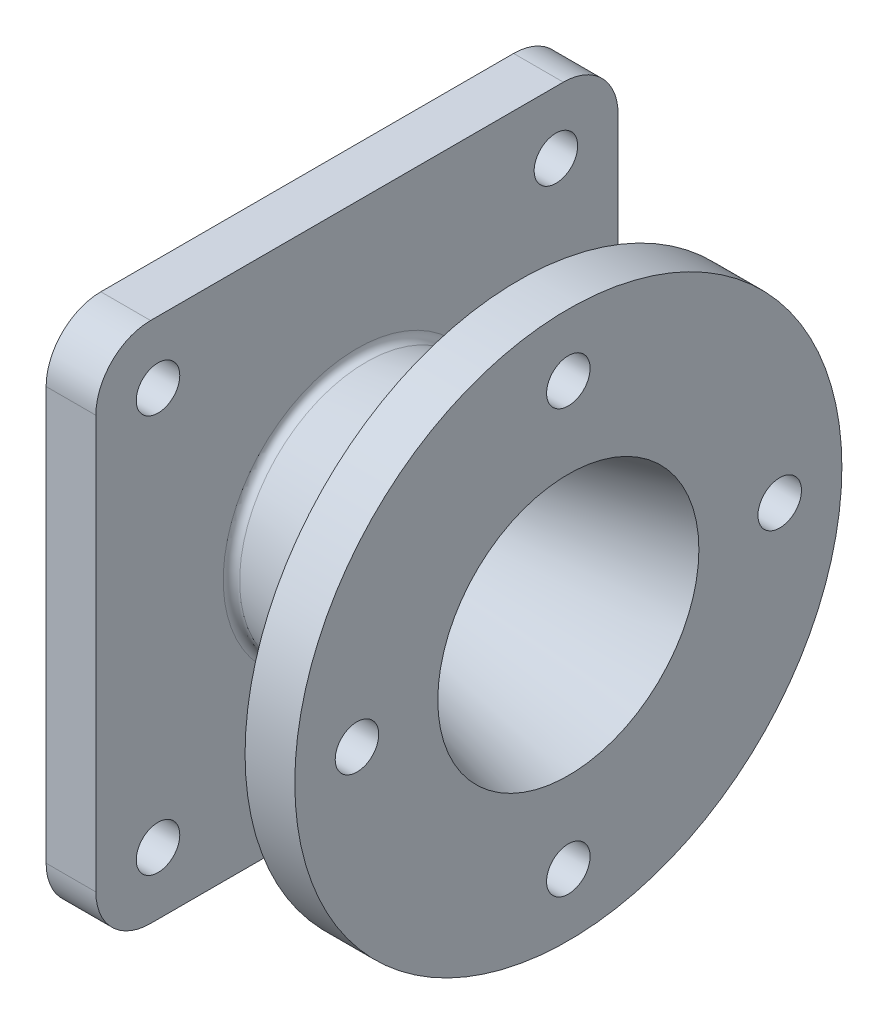
ISO-10303-21;
HEADER;
FILE_DESCRIPTION(('STEP AP214'),'2;1');
FILE_NAME('part.step','',(''),(''),'','','');
FILE_SCHEMA(('AUTOMOTIVE_DESIGN { 1 0 10303 214 1 1 1 1 }'));
ENDSEC;
DATA;
#1=APPLICATION_CONTEXT('core data for automotive mechanical design processes');
#2=APPLICATION_PROTOCOL_DEFINITION('international standard','automotive_design',2000,#1);
#3=PRODUCT_CONTEXT('',#1,'mechanical');
#4=PRODUCT('Part','Part','',(#3));
#5=PRODUCT_RELATED_PRODUCT_CATEGORY('part','',(#4));
#6=PRODUCT_DEFINITION_FORMATION('','',#4);
#7=PRODUCT_DEFINITION_CONTEXT('part definition',#1,'design');
#8=PRODUCT_DEFINITION('design','',#6,#7);
#9=PRODUCT_DEFINITION_SHAPE('','',#8);
#10=(LENGTH_UNIT() NAMED_UNIT(*) SI_UNIT(.MILLI.,.METRE.));
#11=(NAMED_UNIT(*) PLANE_ANGLE_UNIT() SI_UNIT($,.RADIAN.));
#12=(NAMED_UNIT(*) SI_UNIT($,.STERADIAN.) SOLID_ANGLE_UNIT());
#13=UNCERTAINTY_MEASURE_WITH_UNIT(LENGTH_MEASURE(1.E-05),#10,'distance_accuracy_value','');
#14=(GEOMETRIC_REPRESENTATION_CONTEXT(3) GLOBAL_UNCERTAINTY_ASSIGNED_CONTEXT((#13)) GLOBAL_UNIT_ASSIGNED_CONTEXT((#10,
#11,#12)) REPRESENTATION_CONTEXT('',''));
#15=CARTESIAN_POINT('',(0.,0.,0.));
#16=DIRECTION('',(0.,0.,1.));
#17=DIRECTION('',(1.,0.,0.));
#18=AXIS2_PLACEMENT_3D('',#15,#16,#17);
#19=CARTESIAN_POINT('',(-105.,0.,4.51745065771862E-13));
#20=DIRECTION('',(1.,0.,0.));
#21=DIRECTION('',(0.,0.,-1.00000000000003));
#22=AXIS2_PLACEMENT_3D('',#19,#20,#21);
#23=CONICAL_SURFACE('',#22,25.,0.256151382565604);
#24=CARTESIAN_POINT('',(0.,0.,0.));
#25=DIRECTION('',(1.,0.,0.));
#26=DIRECTION('',(0.,0.,-1.00000000000003));
#27=AXIS2_PLACEMENT_3D('',#24,#25,#26);
#28=CIRCLE('',#27,52.5);
#29=CARTESIAN_POINT('',(2.25872532885931E-13,0.,-52.5000000000015));
#30=VERTEX_POINT('',#29);
#31=EDGE_CURVE('E225',#30,#30,#28,.T.);
#32=ORIENTED_EDGE('',*,*,#31,.T.);
#33=EDGE_LOOP('',(#32));
#34=FACE_BOUND('',#33,.T.);
#35=CARTESIAN_POINT('',(-105.,0.,4.51745065771862E-13));
#36=DIRECTION('',(1.,0.,0.));
#37=DIRECTION('',(0.,0.,-1.00000000000003));
#38=AXIS2_PLACEMENT_3D('',#35,#36,#37);
#39=CIRCLE('',#38,25.);
#40=CARTESIAN_POINT('',(-105.,0.,-25.0000000000003));
#41=VERTEX_POINT('',#40);
#42=EDGE_CURVE('E137',#41,#41,#39,.T.);
#43=ORIENTED_EDGE('',*,*,#42,.F.);
#44=EDGE_LOOP('',(#43));
#45=FACE_BOUND('',#44,.T.);
#46=ADVANCED_FACE('F49',(#34,#45),#23,.F.);
#47=CARTESIAN_POINT('',(-105.,25.0000000000008,4.05948366006073E-13));
#48=DIRECTION('',(-1.,0.,0.));
#49=DIRECTION('',(0.,0.,1.00000000000003));
#50=AXIS2_PLACEMENT_3D('',#47,#48,#49);
#51=PLANE('',#50);
#52=ORIENTED_EDGE('',*,*,#42,.T.);
#53=EDGE_LOOP('',(#52));
#54=FACE_BOUND('',#53,.T.);
#55=CARTESIAN_POINT('',(-105.,0.,4.51745065771862E-13));
#56=DIRECTION('',(1.,0.,0.));
#57=DIRECTION('',(0.,0.,-1.00000000000003));
#58=AXIS2_PLACEMENT_3D('',#55,#56,#57);
#59=CIRCLE('',#58,35.);
#60=CARTESIAN_POINT('',(-105.,0.,-35.0000000000006));
#61=VERTEX_POINT('',#60);
#62=EDGE_CURVE('E141',#61,#61,#59,.T.);
#63=ORIENTED_EDGE('',*,*,#62,.F.);
#64=EDGE_LOOP('',(#63));
#65=FACE_BOUND('',#64,.T.);
#66=ADVANCED_FACE('F242',(#54,#65),#51,.T.);
#67=CARTESIAN_POINT('',(0.,0.,0.));
#68=DIRECTION('',(1.,0.,0.));
#69=DIRECTION('',(0.,0.,-1.00000000000003));
#70=AXIS2_PLACEMENT_3D('',#67,#68,#69);
#71=CYLINDRICAL_SURFACE('',#70,35.);
#72=ORIENTED_EDGE('',*,*,#62,.T.);
#73=EDGE_LOOP('',(#72));
#74=FACE_BOUND('',#73,.T.);
#75=CARTESIAN_POINT('',(-113.,0.,4.86163737449719E-13));
#76=DIRECTION('',(1.,0.,0.));
#77=DIRECTION('',(0.,0.,-1.00000000000003));
#78=AXIS2_PLACEMENT_3D('',#75,#76,#77);
#79=CIRCLE('',#78,35.);
#80=CARTESIAN_POINT('',(-113.,0.,-35.0000000000005));
#81=VERTEX_POINT('',#80);
#82=EDGE_CURVE('E234',#81,#81,#79,.T.);
#83=ORIENTED_EDGE('',*,*,#82,.F.);
#84=EDGE_LOOP('',(#83));
#85=FACE_BOUND('',#84,.T.);
#86=ADVANCED_FACE('F239',(#74,#85),#71,.F.);
#87=CARTESIAN_POINT('',(-113.,35.0000000000008,4.22048357777615E-13));
#88=DIRECTION('',(1.,0.,0.));
#89=DIRECTION('',(0.,0.,-1.00000000000003));
#90=AXIS2_PLACEMENT_3D('',#87,#88,#89);
#91=PLANE('',#90);
#92=ORIENTED_EDGE('',*,*,#82,.T.);
#93=EDGE_LOOP('',(#92));
#94=FACE_BOUND('',#93,.T.);
#95=CARTESIAN_POINT('',(-113.,0.,4.86163737449719E-13));
#96=DIRECTION('',(1.,0.,0.));
#97=DIRECTION('',(0.,0.,-1.00000000000003));
#98=AXIS2_PLACEMENT_3D('',#95,#96,#97);
#99=CIRCLE('',#98,28.7125);
#100=CARTESIAN_POINT('',(-113.,0.,-28.7125000000003));
#101=VERTEX_POINT('',#100);
#102=EDGE_CURVE('E231',#101,#101,#99,.T.);
#103=ORIENTED_EDGE('',*,*,#102,.F.);
#104=EDGE_LOOP('',(#103));
#105=FACE_BOUND('',#104,.T.);
#106=ADVANCED_FACE('F250',(#94,#105),#91,.T.);
#107=CARTESIAN_POINT('',(0.,0.,0.));
#108=DIRECTION('',(1.,0.,0.));
#109=DIRECTION('',(0.,0.,-1.00000000000003));
#110=AXIS2_PLACEMENT_3D('',#107,#108,#109);
#111=CYLINDRICAL_SURFACE('',#110,28.7125);
#112=CARTESIAN_POINT('',(-126.7125,0.,5.45159491872543E-13));
#113=DIRECTION('',(-1.,0.,0.));
#114=DIRECTION('',(0.,0.,1.00000000000003));
#115=AXIS2_PLACEMENT_3D('',#112,#113,#114);
#116=CIRCLE('',#115,28.7125);
#117=CARTESIAN_POINT('',(-126.7125,0.,28.7125000000014));
#118=VERTEX_POINT('',#117);
#119=EDGE_CURVE('E173',#118,#118,#116,.T.);
#120=ORIENTED_EDGE('',*,*,#119,.T.);
#121=EDGE_LOOP('',(#120));
#122=FACE_BOUND('',#121,.T.);
#123=ORIENTED_EDGE('',*,*,#102,.T.);
#124=EDGE_LOOP('',(#123));
#125=FACE_BOUND('',#124,.T.);
#126=ADVANCED_FACE('F289',(#122,#125),#111,.F.);
#127=CARTESIAN_POINT('',(-130.,62.5000000000024,4.4481166535069E-13));
#128=DIRECTION('',(-1.,0.,0.));
#129=DIRECTION('',(0.,0.,1.00000000000003));
#130=AXIS2_PLACEMENT_3D('',#127,#128,#129);
#131=PLANE('',#130);
#132=CARTESIAN_POINT('',(-130.,0.,5.59303414765163E-13));
#133=DIRECTION('',(-1.,0.,0.));
#134=DIRECTION('',(0.,0.,1.00000000000003));
#135=AXIS2_PLACEMENT_3D('',#132,#133,#134);
#136=CIRCLE('',#135,31.9999999999999);
#137=CARTESIAN_POINT('',(-130.,0.,32.0000000000014));
#138=VERTEX_POINT('',#137);
#139=EDGE_CURVE('E170',#138,#138,#136,.F.);
#140=ORIENTED_EDGE('',*,*,#139,.T.);
#141=EDGE_LOOP('',(#140));
#142=FACE_BOUND('',#141,.T.);
#143=CARTESIAN_POINT('',(-130.,0.,5.59303414765163E-13));
#144=DIRECTION('',(1.,0.,0.));
#145=DIRECTION('',(0.,0.,-1.00000000000003));
#146=AXIS2_PLACEMENT_3D('',#143,#144,#145);
#147=CIRCLE('',#146,62.5);
#148=CARTESIAN_POINT('',(-130.,1.14316369709669E-13,-62.5000000000013));
#149=VERTEX_POINT('',#148);
#150=EDGE_CURVE('E222',#149,#149,#147,.T.);
#151=ORIENTED_EDGE('',*,*,#150,.F.);
#152=EDGE_LOOP('',(#151));
#153=FACE_BOUND('',#152,.T.);
#154=ADVANCED_FACE('F285',(#142,#153),#131,.T.);
#155=CARTESIAN_POINT('',(0.,0.,0.));
#156=DIRECTION('',(1.,0.,0.));
#157=DIRECTION('',(0.,0.,-1.00000000000003));
#158=AXIS2_PLACEMENT_3D('',#155,#156,#157);
#159=CYLINDRICAL_SURFACE('',#158,62.5);
#160=ORIENTED_EDGE('',*,*,#150,.T.);
#161=EDGE_LOOP('',(#160));
#162=FACE_BOUND('',#161,.T.);
#163=CARTESIAN_POINT('',(-105.,0.,4.51745065771862E-13));
#164=DIRECTION('',(1.,0.,0.));
#165=DIRECTION('',(0.,0.,-1.00000000000003));
#166=AXIS2_PLACEMENT_3D('',#163,#164,#165);
#167=CIRCLE('',#166,62.5);
#168=CARTESIAN_POINT('',(-105.,1.14350096575978E-13,-62.5000000000014));
#169=VERTEX_POINT('',#168);
#170=EDGE_CURVE('E218',#169,#169,#167,.T.);
#171=ORIENTED_EDGE('',*,*,#170,.F.);
#172=EDGE_LOOP('',(#171));
#173=FACE_BOUND('',#172,.T.);
#174=ADVANCED_FACE('F288',(#162,#173),#159,.T.);
#175=CARTESIAN_POINT('',(-105.,105.000000000004,2.5939892675555E-13));
#176=DIRECTION('',(-1.,0.,0.));
#177=DIRECTION('',(0.,0.,1.00000000000003));
#178=AXIS2_PLACEMENT_3D('',#175,#176,#177);
#179=PLANE('',#178);
#180=CARTESIAN_POINT('',(-105.,80.0000000000036,-80.0000000000001));
#181=DIRECTION('',(-1.,0.,0.));
#182=DIRECTION('',(0.,1.00000000000003,0.));
#183=AXIS2_PLACEMENT_3D('',#180,#181,#182);
#184=CIRCLE('',#183,8.74999999999999);
#185=CARTESIAN_POINT('',(-105.,88.7500000000038,-80.));
#186=VERTEX_POINT('',#185);
#187=EDGE_CURVE('E580',#186,#186,#184,.T.);
#188=ORIENTED_EDGE('',*,*,#187,.F.);
#189=EDGE_LOOP('',(#188));
#190=FACE_BOUND('',#189,.T.);
#191=CARTESIAN_POINT('',(-105.,-80.000000000001,-80.));
#192=DIRECTION('',(-1.,0.,0.));
#193=DIRECTION('',(0.,0.,-1.00000000000003));
#194=AXIS2_PLACEMENT_3D('',#191,#192,#193);
#195=CIRCLE('',#194,8.74999999999999);
#196=CARTESIAN_POINT('',(-105.,-80.0000000000009,-88.7500000000003));
#197=VERTEX_POINT('',#196);
#198=EDGE_CURVE('E576',#197,#197,#195,.T.);
#199=ORIENTED_EDGE('',*,*,#198,.F.);
#200=EDGE_LOOP('',(#199));
#201=FACE_BOUND('',#200,.T.);
#202=CARTESIAN_POINT('',(-105.,-80.0000000000012,80.0000000000034));
#203=DIRECTION('',(-1.,0.,0.));
#204=DIRECTION('',(0.,-1.00000000000003,0.));
#205=AXIS2_PLACEMENT_3D('',#202,#203,#204);
#206=CIRCLE('',#205,8.74999999999999);
#207=CARTESIAN_POINT('',(-105.,-88.7500000000015,80.0000000000033));
#208=VERTEX_POINT('',#207);
#209=EDGE_CURVE('E572',#208,#208,#206,.T.);
#210=ORIENTED_EDGE('',*,*,#209,.F.);
#211=EDGE_LOOP('',(#210));
#212=FACE_BOUND('',#211,.T.);
#213=CARTESIAN_POINT('',(-105.,80.0000000000027,80.0000000000027));
#214=DIRECTION('',(-1.,0.,0.));
#215=DIRECTION('',(0.,0.,1.00000000000003));
#216=AXIS2_PLACEMENT_3D('',#213,#214,#215);
#217=CIRCLE('',#216,8.74999999999999);
#218=CARTESIAN_POINT('',(-105.,80.0000000000027,88.750000000003));
#219=VERTEX_POINT('',#218);
#220=EDGE_CURVE('E567',#219,#219,#217,.T.);
#221=ORIENTED_EDGE('',*,*,#220,.F.);
#222=EDGE_LOOP('',(#221));
#223=FACE_BOUND('',#222,.T.);
#224=ORIENTED_EDGE('',*,*,#170,.T.);
#225=EDGE_LOOP('',(#224));
#226=FACE_BOUND('',#225,.T.);
#227=DIRECTION('',(0.,0.,-1.00000000000003));
#228=VECTOR('',#227,1.);
#229=CARTESIAN_POINT('',(-105.,105.000000000005,-105.000000000003));
#230=LINE('',#229,#228);
#231=CARTESIAN_POINT('',(-105.,105.000000000004,83.0000000000027));
#232=VERTEX_POINT('',#231);
#233=CARTESIAN_POINT('',(-105.,105.000000000004,-83.0000000000009));
#234=VERTEX_POINT('',#233);
#235=EDGE_CURVE('E119',#232,#234,#230,.T.);
#236=ORIENTED_EDGE('',*,*,#235,.T.);
#237=CARTESIAN_POINT('',(-105.,83.0000000000027,-83.000000000001));
#238=DIRECTION('',(-1.,0.,0.));
#239=DIRECTION('',(0.,0.,1.00000000000003));
#240=AXIS2_PLACEMENT_3D('',#237,#238,#239);
#241=CIRCLE('',#240,22.);
#242=CARTESIAN_POINT('',(-105.,83.0000000000034,-105.000000000003));
#243=VERTEX_POINT('',#242);
#244=EDGE_CURVE('E148',#234,#243,#241,.T.);
#245=ORIENTED_EDGE('',*,*,#244,.T.);
#246=DIRECTION('',(0.,-1.00000000000003,0.));
#247=VECTOR('',#246,1.);
#248=CARTESIAN_POINT('',(-105.,-105.000000000002,-105.000000000002));
#249=LINE('',#248,#247);
#250=CARTESIAN_POINT('',(-105.,-83.0000000000009,-105.000000000002));
#251=VERTEX_POINT('',#250);
#252=EDGE_CURVE('E134',#243,#251,#249,.T.);
#253=ORIENTED_EDGE('',*,*,#252,.T.);
#254=CARTESIAN_POINT('',(-105.,-83.0000000000015,-83.0000000000006));
#255=DIRECTION('',(-1.,0.,0.));
#256=DIRECTION('',(0.,0.,1.00000000000003));
#257=AXIS2_PLACEMENT_3D('',#254,#255,#256);
#258=CIRCLE('',#257,22.);
#259=CARTESIAN_POINT('',(-105.,-105.000000000003,-83.0000000000006));
#260=VERTEX_POINT('',#259);
#261=EDGE_CURVE('E146',#251,#260,#258,.T.);
#262=ORIENTED_EDGE('',*,*,#261,.T.);
#263=DIRECTION('',(0.,0.,1.00000000000003));
#264=VECTOR('',#263,1.);
#265=CARTESIAN_POINT('',(-105.,-105.000000000002,-105.000000000002));
#266=LINE('',#265,#264);
#267=CARTESIAN_POINT('',(-105.,-105.000000000003,83.000000000003));
#268=VERTEX_POINT('',#267);
#269=EDGE_CURVE('E517',#260,#268,#266,.T.);
#270=ORIENTED_EDGE('',*,*,#269,.T.);
#271=CARTESIAN_POINT('',(-105.,-83.0000000000015,83.000000000003));
#272=DIRECTION('',(-1.,0.,0.));
#273=DIRECTION('',(0.,0.,1.00000000000003));
#274=AXIS2_PLACEMENT_3D('',#271,#272,#273);
#275=CIRCLE('',#274,22.);
#276=CARTESIAN_POINT('',(-105.,-83.0000000000021,105.000000000005));
#277=VERTEX_POINT('',#276);
#278=EDGE_CURVE('E125',#268,#277,#275,.T.);
#279=ORIENTED_EDGE('',*,*,#278,.T.);
#280=DIRECTION('',(0.,1.00000000000003,0.));
#281=VECTOR('',#280,1.);
#282=CARTESIAN_POINT('',(-105.,-105.000000000003,105.000000000005));
#283=LINE('',#282,#281);
#284=CARTESIAN_POINT('',(-105.,83.0000000000021,105.000000000005));
#285=VERTEX_POINT('',#284);
#286=EDGE_CURVE('E120',#277,#285,#283,.T.);
#287=ORIENTED_EDGE('',*,*,#286,.T.);
#288=CARTESIAN_POINT('',(-105.,83.0000000000027,83.0000000000027));
#289=DIRECTION('',(-1.,0.,0.));
#290=DIRECTION('',(0.,0.,1.00000000000003));
#291=AXIS2_PLACEMENT_3D('',#288,#289,#290);
#292=CIRCLE('',#291,22.);
#293=EDGE_CURVE('E116',#285,#232,#292,.T.);
#294=ORIENTED_EDGE('',*,*,#293,.T.);
#295=EDGE_LOOP('',(#236,#245,#253,#262,#270,#279,#287,#294));
#296=FACE_BOUND('',#295,.T.);
#297=ADVANCED_FACE('F118',(#190,#201,#212,#223,#226,#296),#179,.T.);
#298=CARTESIAN_POINT('',(-85.,50.0000000000014,2.74104987045644E-13));
#299=DIRECTION('',(1.,0.,0.));
#300=DIRECTION('',(0.,0.,-1.00000000000003));
#301=AXIS2_PLACEMENT_3D('',#298,#299,#300);
#302=PLANE('',#301);
#303=CARTESIAN_POINT('',(-85.,0.,3.65698386577222E-13));
#304=DIRECTION('',(1.,0.,0.));
#305=DIRECTION('',(0.,0.,-1.00000000000003));
#306=AXIS2_PLACEMENT_3D('',#303,#304,#305);
#307=CIRCLE('',#306,53.7711532455676);
#308=CARTESIAN_POINT('',(-84.9999999999998,0.,-53.7711532455688));
#309=VERTEX_POINT('',#308);
#310=EDGE_CURVE('E13',#309,#309,#307,.F.);
#311=ORIENTED_EDGE('',*,*,#310,.T.);
#312=EDGE_LOOP('',(#311));
#313=FACE_BOUND('',#312,.T.);
#314=CARTESIAN_POINT('',(-85.,80.0000000000027,-80.0000000000001));
#315=DIRECTION('',(1.,0.,0.));
#316=DIRECTION('',(0.,0.,-1.00000000000003));
#317=AXIS2_PLACEMENT_3D('',#314,#315,#316);
#318=CIRCLE('',#317,8.74999999999999);
#319=CARTESIAN_POINT('',(-85.,80.0000000000027,-88.7500000000003));
#320=VERTEX_POINT('',#319);
#321=EDGE_CURVE('E492',#320,#320,#318,.F.);
#322=ORIENTED_EDGE('',*,*,#321,.T.);
#323=EDGE_LOOP('',(#322));
#324=FACE_BOUND('',#323,.T.);
#325=CARTESIAN_POINT('',(-85.,-80.0000000000019,-80.0000000000003));
#326=DIRECTION('',(1.,0.,0.));
#327=DIRECTION('',(0.,0.,-1.00000000000003));
#328=AXIS2_PLACEMENT_3D('',#325,#326,#327);
#329=CIRCLE('',#328,8.74999999999999);
#330=CARTESIAN_POINT('',(-85.,-80.0000000000018,-88.7500000000006));
#331=VERTEX_POINT('',#330);
#332=EDGE_CURVE('E496',#331,#331,#329,.F.);
#333=ORIENTED_EDGE('',*,*,#332,.T.);
#334=EDGE_LOOP('',(#333));
#335=FACE_BOUND('',#334,.T.);
#336=CARTESIAN_POINT('',(-85.,-80.0000000000021,80.0000000000031));
#337=DIRECTION('',(1.,0.,0.));
#338=DIRECTION('',(0.,0.,-1.00000000000003));
#339=AXIS2_PLACEMENT_3D('',#336,#337,#338);
#340=CIRCLE('',#339,8.74999999999999);
#341=CARTESIAN_POINT('',(-85.,-80.0000000000021,71.2500000000028));
#342=VERTEX_POINT('',#341);
#343=EDGE_CURVE('E500',#342,#342,#340,.F.);
#344=ORIENTED_EDGE('',*,*,#343,.T.);
#345=EDGE_LOOP('',(#344));
#346=FACE_BOUND('',#345,.T.);
#347=CARTESIAN_POINT('',(-85.,80.0000000000018,80.0000000000027));
#348=DIRECTION('',(1.,0.,0.));
#349=DIRECTION('',(0.,0.,-1.00000000000003));
#350=AXIS2_PLACEMENT_3D('',#347,#348,#349);
#351=CIRCLE('',#350,8.74999999999999);
#352=CARTESIAN_POINT('',(-85.,80.0000000000018,71.2500000000025));
#353=VERTEX_POINT('',#352);
#354=EDGE_CURVE('E503',#353,#353,#351,.F.);
#355=ORIENTED_EDGE('',*,*,#354,.T.);
#356=EDGE_LOOP('',(#355));
#357=FACE_BOUND('',#356,.T.);
#358=DIRECTION('',(0.,-1.00000000000003,0.));
#359=VECTOR('',#358,1.);
#360=CARTESIAN_POINT('',(-85.,-105.000000000003,-105.000000000002));
#361=LINE('',#360,#359);
#362=CARTESIAN_POINT('',(-85.,83.0000000000024,-105.000000000003));
#363=VERTEX_POINT('',#362);
#364=CARTESIAN_POINT('',(-85.,-83.0000000000018,-105.000000000002));
#365=VERTEX_POINT('',#364);
#366=EDGE_CURVE('E506',#363,#365,#361,.T.);
#367=ORIENTED_EDGE('',*,*,#366,.F.);
#368=CARTESIAN_POINT('',(-85.,83.0000000000018,-83.000000000001));
#369=DIRECTION('',(1.,0.,0.));
#370=DIRECTION('',(0.,0.,-1.00000000000003));
#371=AXIS2_PLACEMENT_3D('',#368,#369,#370);
#372=CIRCLE('',#371,22.);
#373=CARTESIAN_POINT('',(-85.,105.000000000003,-83.0000000000009));
#374=VERTEX_POINT('',#373);
#375=EDGE_CURVE('E160',#363,#374,#372,.T.);
#376=ORIENTED_EDGE('',*,*,#375,.T.);
#377=DIRECTION('',(0.,0.,-1.00000000000003));
#378=VECTOR('',#377,1.);
#379=CARTESIAN_POINT('',(-85.,105.000000000004,-105.000000000003));
#380=LINE('',#379,#378);
#381=CARTESIAN_POINT('',(-85.,105.000000000003,83.0000000000027));
#382=VERTEX_POINT('',#381);
#383=EDGE_CURVE('E511',#382,#374,#380,.T.);
#384=ORIENTED_EDGE('',*,*,#383,.F.);
#385=CARTESIAN_POINT('',(-85.,83.0000000000018,83.0000000000027));
#386=DIRECTION('',(1.,0.,0.));
#387=DIRECTION('',(0.,0.,-1.00000000000003));
#388=AXIS2_PLACEMENT_3D('',#385,#386,#387);
#389=CIRCLE('',#388,22.);
#390=CARTESIAN_POINT('',(-85.,83.0000000000012,105.000000000005));
#391=VERTEX_POINT('',#390);
#392=EDGE_CURVE('E64',#382,#391,#389,.T.);
#393=ORIENTED_EDGE('',*,*,#392,.T.);
#394=DIRECTION('',(0.,1.00000000000003,0.));
#395=VECTOR('',#394,1.);
#396=CARTESIAN_POINT('',(-85.,-105.000000000004,105.000000000005));
#397=LINE('',#396,#395);
#398=CARTESIAN_POINT('',(-85.,-83.000000000003,105.000000000005));
#399=VERTEX_POINT('',#398);
#400=EDGE_CURVE('E525',#399,#391,#397,.T.);
#401=ORIENTED_EDGE('',*,*,#400,.F.);
#402=CARTESIAN_POINT('',(-85.,-83.0000000000024,83.000000000003));
#403=DIRECTION('',(1.,0.,0.));
#404=DIRECTION('',(0.,0.,-1.00000000000003));
#405=AXIS2_PLACEMENT_3D('',#402,#403,#404);
#406=CIRCLE('',#405,22.);
#407=CARTESIAN_POINT('',(-85.,-105.000000000004,83.000000000003));
#408=VERTEX_POINT('',#407);
#409=EDGE_CURVE('E156',#399,#408,#406,.T.);
#410=ORIENTED_EDGE('',*,*,#409,.T.);
#411=DIRECTION('',(0.,0.,1.00000000000003));
#412=VECTOR('',#411,1.);
#413=CARTESIAN_POINT('',(-85.,-105.000000000003,-105.000000000002));
#414=LINE('',#413,#412);
#415=CARTESIAN_POINT('',(-85.,-105.000000000004,-83.0000000000006));
#416=VERTEX_POINT('',#415);
#417=EDGE_CURVE('E512',#416,#408,#414,.T.);
#418=ORIENTED_EDGE('',*,*,#417,.F.);
#419=CARTESIAN_POINT('',(-85.,-83.0000000000024,-83.0000000000006));
#420=DIRECTION('',(1.,0.,0.));
#421=DIRECTION('',(0.,0.,-1.00000000000003));
#422=AXIS2_PLACEMENT_3D('',#419,#420,#421);
#423=CIRCLE('',#422,22.);
#424=EDGE_CURVE('E158',#416,#365,#423,.T.);
#425=ORIENTED_EDGE('',*,*,#424,.T.);
#426=EDGE_LOOP('',(#367,#376,#384,#393,#401,#410,#418,#425));
#427=FACE_BOUND('',#426,.T.);
#428=ADVANCED_FACE('F299',(#313,#324,#335,#346,#357,#427),#302,.T.);
#429=CARTESIAN_POINT('',(-20.,0.,0.));
#430=DIRECTION('',(1.,0.,0.));
#431=DIRECTION('',(0.,0.,-1.00000000000003));
#432=AXIS2_PLACEMENT_3D('',#429,#430,#431);
#433=CONICAL_SURFACE('',#432,65.,0.226798848053886);
#434=CARTESIAN_POINT('',(-22.3254214799037,0.,0.));
#435=DIRECTION('',(1.,0.,0.));
#436=DIRECTION('',(0.,0.,-1.00000000000003));
#437=AXIS2_PLACEMENT_3D('',#434,#435,#436);
#438=CIRCLE('',#437,64.4633642738684);
#439=CARTESIAN_POINT('',(-22.3254214799034,1.24997148825408E-13,-64.4633642738702));
#440=VERTEX_POINT('',#439);
#441=EDGE_CURVE('E57',#440,#440,#438,.F.);
#442=ORIENTED_EDGE('',*,*,#441,.T.);
#443=EDGE_LOOP('',(#442));
#444=FACE_BOUND('',#443,.T.);
#445=CARTESIAN_POINT('',(-81.3254214799037,0.,3.49889122622511E-13));
#446=DIRECTION('',(1.,0.,0.));
#447=DIRECTION('',(0.,0.,-1.00000000000003));
#448=AXIS2_PLACEMENT_3D('',#445,#446,#447);
#449=CIRCLE('',#448,50.8479796584837);
#450=CARTESIAN_POINT('',(-81.3254214799035,0.,-50.8479796584849));
#451=VERTEX_POINT('',#450);
#452=EDGE_CURVE('E179',#451,#451,#449,.T.);
#453=ORIENTED_EDGE('',*,*,#452,.T.);
#454=EDGE_LOOP('',(#453));
#455=FACE_BOUND('',#454,.T.);
#456=ADVANCED_FACE('F184',(#444,#455),#433,.T.);
#457=CARTESIAN_POINT('',(-19.9999999999999,110.000000000004,-1.15458799774835E-13));
#458=DIRECTION('',(-1.,0.,0.));
#459=DIRECTION('',(0.,0.,1.00000000000003));
#460=AXIS2_PLACEMENT_3D('',#457,#458,#459);
#461=PLANE('',#460);
#462=CARTESIAN_POINT('',(-20.,0.,0.));
#463=DIRECTION('',(-1.,0.,0.));
#464=DIRECTION('',(0.,0.,1.00000000000003));
#465=AXIS2_PLACEMENT_3D('',#462,#463,#464);
#466=CIRCLE('',#465,67.3865378609522);
#467=CARTESIAN_POINT('',(-20.0000000000003,-1.23470223200007E-13,67.3865378609543));
#468=VERTEX_POINT('',#467);
#469=EDGE_CURVE('E176',#468,#468,#466,.F.);
#470=ORIENTED_EDGE('',*,*,#469,.T.);
#471=EDGE_LOOP('',(#470));
#472=FACE_BOUND('',#471,.T.);
#473=CARTESIAN_POINT('',(-20.,1.01020658197681E-12,-85.0000000000009));
#474=DIRECTION('',(-1.,0.,0.));
#475=DIRECTION('',(0.,0.,1.00000000000003));
#476=AXIS2_PLACEMENT_3D('',#473,#474,#475);
#477=CIRCLE('',#476,8.75);
#478=CARTESIAN_POINT('',(-20.0000000000001,9.94177737058781E-13,-76.2500000000007));
#479=VERTEX_POINT('',#478);
#480=EDGE_CURVE('E201',#479,#479,#477,.F.);
#481=ORIENTED_EDGE('',*,*,#480,.T.);
#482=EDGE_LOOP('',(#481));
#483=FACE_BOUND('',#482,.T.);
#484=CARTESIAN_POINT('',(-20.,-85.0000000000025,2.41755458398324E-13));
#485=DIRECTION('',(-1.,0.,0.));
#486=DIRECTION('',(0.,0.,1.00000000000003));
#487=AXIS2_PLACEMENT_3D('',#484,#485,#486);
#488=CIRCLE('',#487,8.75);
#489=CARTESIAN_POINT('',(-20.0000000000001,-85.0000000000025,8.7500000000005));
#490=VERTEX_POINT('',#489);
#491=EDGE_CURVE('E205',#490,#490,#488,.F.);
#492=ORIENTED_EDGE('',*,*,#491,.T.);
#493=EDGE_LOOP('',(#492));
#494=FACE_BOUND('',#493,.T.);
#495=CARTESIAN_POINT('',(-20.,-4.16985116178832E-13,85.0000000000028));
#496=DIRECTION('',(-1.,0.,0.));
#497=DIRECTION('',(0.,0.,1.00000000000003));
#498=AXIS2_PLACEMENT_3D('',#495,#496,#497);
#499=CIRCLE('',#498,8.75);
#500=CARTESIAN_POINT('',(-20.0000000000001,-4.33013961096858E-13,93.750000000003));
#501=VERTEX_POINT('',#500);
#502=EDGE_CURVE('E209',#501,#501,#499,.F.);
#503=ORIENTED_EDGE('',*,*,#502,.T.);
#504=EDGE_LOOP('',(#503));
#505=FACE_BOUND('',#504,.T.);
#506=CARTESIAN_POINT('',(-19.9999999999999,85.0000000000018,0.));
#507=DIRECTION('',(-1.,0.,0.));
#508=DIRECTION('',(0.,0.,1.00000000000003));
#509=AXIS2_PLACEMENT_3D('',#506,#507,#508);
#510=CIRCLE('',#509,8.75);
#511=CARTESIAN_POINT('',(-19.9999999999999,85.0000000000018,8.75000000000019));
#512=VERTEX_POINT('',#511);
#513=EDGE_CURVE('E213',#512,#512,#510,.F.);
#514=ORIENTED_EDGE('',*,*,#513,.T.);
#515=EDGE_LOOP('',(#514));
#516=FACE_BOUND('',#515,.T.);
#517=CARTESIAN_POINT('',(-19.9999999999999,0.,0.));
#518=DIRECTION('',(1.,0.,0.));
#519=DIRECTION('',(0.,0.,-1.00000000000003));
#520=AXIS2_PLACEMENT_3D('',#517,#518,#519);
#521=CIRCLE('',#520,110.);
#522=CARTESIAN_POINT('',(-19.9999999999994,2.01478497476425E-13,-110.000000000003));
#523=VERTEX_POINT('',#522);
#524=EDGE_CURVE('E216',#523,#523,#521,.T.);
#525=ORIENTED_EDGE('',*,*,#524,.F.);
#526=EDGE_LOOP('',(#525));
#527=FACE_BOUND('',#526,.T.);
#528=ADVANCED_FACE('F193',(#472,#483,#494,#505,#516,#527),#461,.T.);
#529=CARTESIAN_POINT('',(0.,0.,0.));
#530=DIRECTION('',(1.,0.,0.));
#531=DIRECTION('',(0.,0.,-1.00000000000003));
#532=AXIS2_PLACEMENT_3D('',#529,#530,#531);
#533=CYLINDRICAL_SURFACE('',#532,110.);
#534=ORIENTED_EDGE('',*,*,#524,.T.);
#535=EDGE_LOOP('',(#534));
#536=FACE_BOUND('',#535,.T.);
#537=CARTESIAN_POINT('',(0.,0.,0.));
#538=DIRECTION('',(1.,0.,0.));
#539=DIRECTION('',(0.,0.,-1.00000000000003));
#540=AXIS2_PLACEMENT_3D('',#537,#538,#539);
#541=CIRCLE('',#540,110.);
#542=CARTESIAN_POINT('',(4.73256735570522E-13,2.01505478969472E-13,-110.000000000003));
#543=VERTEX_POINT('',#542);
#544=EDGE_CURVE('E219',#543,#543,#541,.T.);
#545=ORIENTED_EDGE('',*,*,#544,.F.);
#546=EDGE_LOOP('',(#545));
#547=FACE_BOUND('',#546,.T.);
#548=ADVANCED_FACE('F196',(#536,#547),#533,.T.);
#549=CARTESIAN_POINT('',(0.,52.5000000000014,0.));
#550=DIRECTION('',(1.,0.,0.));
#551=DIRECTION('',(0.,0.,-1.00000000000003));
#552=AXIS2_PLACEMENT_3D('',#549,#550,#551);
#553=PLANE('',#552);
#554=CARTESIAN_POINT('',(0.,1.00329466956595E-12,-85.0000000000009));
#555=DIRECTION('',(1.,0.,0.));
#556=DIRECTION('',(0.,-1.00000000000003,0.));
#557=AXIS2_PLACEMENT_3D('',#554,#555,#556);
#558=CIRCLE('',#557,8.75);
#559=CARTESIAN_POINT('',(0.,-8.74999999999926,-85.000000000001));
#560=VERTEX_POINT('',#559);
#561=EDGE_CURVE('E529',#560,#560,#558,.T.);
#562=ORIENTED_EDGE('',*,*,#561,.F.);
#563=EDGE_LOOP('',(#562));
#564=FACE_BOUND('',#563,.T.);
#565=CARTESIAN_POINT('',(0.,-85.0000000000018,1.55708779203682E-13));
#566=DIRECTION('',(1.,0.,0.));
#567=DIRECTION('',(0.,0.,1.00000000000003));
#568=AXIS2_PLACEMENT_3D('',#565,#566,#567);
#569=CIRCLE('',#568,8.75);
#570=CARTESIAN_POINT('',(0.,-85.0000000000018,8.75000000000042));
#571=VERTEX_POINT('',#570);
#572=EDGE_CURVE('E533',#571,#571,#569,.T.);
#573=ORIENTED_EDGE('',*,*,#572,.F.);
#574=EDGE_LOOP('',(#573));
#575=FACE_BOUND('',#574,.T.);
#576=CARTESIAN_POINT('',(0.,-4.84612350248881E-13,85.0000000000028));
#577=DIRECTION('',(1.,0.,0.));
#578=DIRECTION('',(0.,1.00000000000003,0.));
#579=AXIS2_PLACEMENT_3D('',#576,#577,#578);
#580=CIRCLE('',#579,8.75);
#581=CARTESIAN_POINT('',(0.,8.74999999999978,85.0000000000028));
#582=VERTEX_POINT('',#581);
#583=EDGE_CURVE('E537',#582,#582,#580,.T.);
#584=ORIENTED_EDGE('',*,*,#583,.F.);
#585=EDGE_LOOP('',(#584));
#586=FACE_BOUND('',#585,.T.);
#587=CARTESIAN_POINT('',(0.,85.0000000000025,-1.55708779203687E-13));
#588=DIRECTION('',(1.,0.,0.));
#589=DIRECTION('',(0.,0.,-1.00000000000003));
#590=AXIS2_PLACEMENT_3D('',#587,#588,#589);
#591=CIRCLE('',#590,8.75);
#592=CARTESIAN_POINT('',(0.,85.0000000000025,-8.75000000000042));
#593=VERTEX_POINT('',#592);
#594=EDGE_CURVE('E541',#593,#593,#591,.T.);
#595=ORIENTED_EDGE('',*,*,#594,.F.);
#596=EDGE_LOOP('',(#595));
#597=FACE_BOUND('',#596,.T.);
#598=ORIENTED_EDGE('',*,*,#544,.T.);
#599=EDGE_LOOP('',(#598));
#600=FACE_BOUND('',#599,.T.);
#601=ORIENTED_EDGE('',*,*,#31,.F.);
#602=EDGE_LOOP('',(#601));
#603=FACE_BOUND('',#602,.T.);
#604=ADVANCED_FACE('F364',(#564,#575,#586,#597,#600,#603),#553,.T.);
#605=CARTESIAN_POINT('',(-130.001,85.0000000000025,4.0359893789544E-13));
#606=DIRECTION('',(1.,0.,0.));
#607=DIRECTION('',(0.,0.,-1.00000000000003));
#608=AXIS2_PLACEMENT_3D('',#605,#606,#607);
#609=CYLINDRICAL_SURFACE('',#608,8.75);
#610=ORIENTED_EDGE('',*,*,#513,.F.);
#611=EDGE_LOOP('',(#610));
#612=FACE_BOUND('',#611,.T.);
#613=ORIENTED_EDGE('',*,*,#594,.T.);
#614=EDGE_LOOP('',(#613));
#615=FACE_BOUND('',#614,.T.);
#616=ADVANCED_FACE('F371',(#612,#615),#609,.F.);
#617=CARTESIAN_POINT('',(-130.001,-4.84787731302759E-13,85.0000000000037));
#618=DIRECTION('',(1.,0.,0.));
#619=DIRECTION('',(0.,0.,-1.00000000000003));
#620=AXIS2_PLACEMENT_3D('',#617,#618,#619);
#621=CYLINDRICAL_SURFACE('',#620,8.75);
#622=ORIENTED_EDGE('',*,*,#502,.F.);
#623=EDGE_LOOP('',(#622));
#624=FACE_BOUND('',#623,.T.);
#625=ORIENTED_EDGE('',*,*,#583,.T.);
#626=EDGE_LOOP('',(#625));
#627=FACE_BOUND('',#626,.T.);
#628=ADVANCED_FACE('F379',(#624,#627),#621,.F.);
#629=CARTESIAN_POINT('',(-130.001,-85.0000000000018,7.15016496302806E-13));
#630=DIRECTION('',(1.,0.,0.));
#631=DIRECTION('',(0.,0.,-1.00000000000003));
#632=AXIS2_PLACEMENT_3D('',#629,#630,#631);
#633=CYLINDRICAL_SURFACE('',#632,8.75);
#634=ORIENTED_EDGE('',*,*,#491,.F.);
#635=EDGE_LOOP('',(#634));
#636=FACE_BOUND('',#635,.T.);
#637=ORIENTED_EDGE('',*,*,#572,.T.);
#638=EDGE_LOOP('',(#637));
#639=FACE_BOUND('',#638,.T.);
#640=ADVANCED_FACE('F387',(#636,#639),#633,.F.);
#641=CARTESIAN_POINT('',(-130.001,1.00311928851207E-12,-85.));
#642=DIRECTION('',(1.,0.,0.));
#643=DIRECTION('',(0.,0.,-1.00000000000003));
#644=AXIS2_PLACEMENT_3D('',#641,#642,#643);
#645=CYLINDRICAL_SURFACE('',#644,8.75);
#646=ORIENTED_EDGE('',*,*,#480,.F.);
#647=EDGE_LOOP('',(#646));
#648=FACE_BOUND('',#647,.T.);
#649=ORIENTED_EDGE('',*,*,#561,.T.);
#650=EDGE_LOOP('',(#649));
#651=FACE_BOUND('',#650,.T.);
#652=ADVANCED_FACE('F394',(#648,#651),#645,.F.);
#653=CARTESIAN_POINT('',(211.98484809835,-105.000000000004,105.000000000003));
#654=DIRECTION('',(0.,0.,1.00000000000003));
#655=DIRECTION('',(1.,0.,0.));
#656=AXIS2_PLACEMENT_3D('',#653,#654,#655);
#657=PLANE('',#656);
#658=ORIENTED_EDGE('',*,*,#286,.F.);
#659=DIRECTION('',(-1.,0.,0.));
#660=VECTOR('',#659,1.);
#661=CARTESIAN_POINT('',(211.98484809835,-83.0000000000024,105.000000000003));
#662=LINE('',#661,#660);
#663=EDGE_CURVE('E71',#277,#399,#662,.F.);
#664=ORIENTED_EDGE('',*,*,#663,.T.);
#665=ORIENTED_EDGE('',*,*,#400,.T.);
#666=DIRECTION('',(-1.,0.,0.));
#667=VECTOR('',#666,1.);
#668=CARTESIAN_POINT('',(211.98484809835,83.0000000000018,105.000000000003));
#669=LINE('',#668,#667);
#670=EDGE_CURVE('E167',#391,#285,#669,.T.);
#671=ORIENTED_EDGE('',*,*,#670,.T.);
#672=EDGE_LOOP('',(#658,#664,#665,#671));
#673=FACE_BOUND('',#672,.T.);
#674=ADVANCED_FACE('F401',(#673),#657,.T.);
#675=CARTESIAN_POINT('',(211.98484809835,-105.000000000003,-105.000000000004));
#676=DIRECTION('',(0.,-1.00000000000003,0.));
#677=DIRECTION('',(0.,0.,-1.00000000000003));
#678=AXIS2_PLACEMENT_3D('',#675,#676,#677);
#679=PLANE('',#678);
#680=ORIENTED_EDGE('',*,*,#269,.F.);
#681=DIRECTION('',(-1.,0.,0.));
#682=VECTOR('',#681,1.);
#683=CARTESIAN_POINT('',(211.98484809835,-105.000000000003,-83.0000000000021));
#684=LINE('',#683,#682);
#685=EDGE_CURVE('E165',#260,#416,#684,.F.);
#686=ORIENTED_EDGE('',*,*,#685,.T.);
#687=ORIENTED_EDGE('',*,*,#417,.T.);
#688=DIRECTION('',(-1.,0.,0.));
#689=VECTOR('',#688,1.);
#690=CARTESIAN_POINT('',(211.98484809835,-105.000000000003,83.0000000000015));
#691=LINE('',#690,#689);
#692=EDGE_CURVE('E162',#408,#268,#691,.T.);
#693=ORIENTED_EDGE('',*,*,#692,.T.);
#694=EDGE_LOOP('',(#680,#686,#687,#693));
#695=FACE_BOUND('',#694,.T.);
#696=ADVANCED_FACE('F408',(#695),#679,.T.);
#697=CARTESIAN_POINT('',(211.98484809835,-105.000000000003,-105.000000000004));
#698=DIRECTION('',(0.,0.,-1.00000000000003));
#699=DIRECTION('',(-1.,0.,0.));
#700=AXIS2_PLACEMENT_3D('',#697,#698,#699);
#701=PLANE('',#700);
#702=ORIENTED_EDGE('',*,*,#252,.F.);
#703=DIRECTION('',(-1.,0.,0.));
#704=VECTOR('',#703,1.);
#705=CARTESIAN_POINT('',(211.98484809835,83.0000000000024,-105.000000000004));
#706=LINE('',#705,#704);
#707=EDGE_CURVE('E153',#243,#363,#706,.F.);
#708=ORIENTED_EDGE('',*,*,#707,.T.);
#709=ORIENTED_EDGE('',*,*,#366,.T.);
#710=DIRECTION('',(-1.,0.,0.));
#711=VECTOR('',#710,1.);
#712=CARTESIAN_POINT('',(211.98484809835,-83.0000000000018,-105.000000000004));
#713=LINE('',#712,#711);
#714=EDGE_CURVE('E150',#365,#251,#713,.T.);
#715=ORIENTED_EDGE('',*,*,#714,.T.);
#716=EDGE_LOOP('',(#702,#708,#709,#715));
#717=FACE_BOUND('',#716,.T.);
#718=ADVANCED_FACE('F415',(#717),#701,.T.);
#719=CARTESIAN_POINT('',(211.98484809835,105.000000000004,-105.000000000004));
#720=DIRECTION('',(0.,1.00000000000003,0.));
#721=DIRECTION('',(0.,0.,1.00000000000003));
#722=AXIS2_PLACEMENT_3D('',#719,#720,#721);
#723=PLANE('',#722);
#724=ORIENTED_EDGE('',*,*,#383,.T.);
#725=DIRECTION('',(-1.,0.,0.));
#726=VECTOR('',#725,1.);
#727=CARTESIAN_POINT('',(211.98484809835,105.000000000004,-83.0000000000021));
#728=LINE('',#727,#726);
#729=EDGE_CURVE('E126',#374,#234,#728,.T.);
#730=ORIENTED_EDGE('',*,*,#729,.T.);
#731=ORIENTED_EDGE('',*,*,#235,.F.);
#732=DIRECTION('',(-1.,0.,0.));
#733=VECTOR('',#732,1.);
#734=CARTESIAN_POINT('',(211.98484809835,105.000000000004,83.0000000000015));
#735=LINE('',#734,#733);
#736=EDGE_CURVE('E132',#232,#382,#735,.F.);
#737=ORIENTED_EDGE('',*,*,#736,.T.);
#738=EDGE_LOOP('',(#724,#730,#731,#737));
#739=FACE_BOUND('',#738,.T.);
#740=ADVANCED_FACE('F131',(#739),#723,.T.);
#741=CARTESIAN_POINT('',(-60.2512626584709,80.0000000000018,80.0000000000027));
#742=DIRECTION('',(-1.,0.,0.));
#743=DIRECTION('',(0.,0.,1.00000000000003));
#744=AXIS2_PLACEMENT_3D('',#741,#742,#743);
#745=CYLINDRICAL_SURFACE('',#744,8.74999999999999);
#746=ORIENTED_EDGE('',*,*,#220,.T.);
#747=EDGE_LOOP('',(#746));
#748=FACE_BOUND('',#747,.T.);
#749=ORIENTED_EDGE('',*,*,#354,.F.);
#750=EDGE_LOOP('',(#749));
#751=FACE_BOUND('',#750,.T.);
#752=ADVANCED_FACE('F260',(#748,#751),#745,.F.);
#753=CARTESIAN_POINT('',(211.98484809835,83.0000000000024,-83.0000000000022));
#754=DIRECTION('',(-1.,0.,0.));
#755=DIRECTION('',(0.,0.,1.00000000000003));
#756=AXIS2_PLACEMENT_3D('',#753,#754,#755);
#757=CYLINDRICAL_SURFACE('',#756,22.);
#758=ORIENTED_EDGE('',*,*,#375,.F.);
#759=ORIENTED_EDGE('',*,*,#707,.F.);
#760=ORIENTED_EDGE('',*,*,#244,.F.);
#761=ORIENTED_EDGE('',*,*,#729,.F.);
#762=EDGE_LOOP('',(#758,#759,#760,#761));
#763=FACE_BOUND('',#762,.T.);
#764=ADVANCED_FACE('F256',(#763),#757,.T.);
#765=CARTESIAN_POINT('',(211.98484809835,-83.0000000000018,-83.0000000000021));
#766=DIRECTION('',(-1.,0.,0.));
#767=DIRECTION('',(0.,0.,1.00000000000003));
#768=AXIS2_PLACEMENT_3D('',#765,#766,#767);
#769=CYLINDRICAL_SURFACE('',#768,22.);
#770=ORIENTED_EDGE('',*,*,#424,.F.);
#771=ORIENTED_EDGE('',*,*,#685,.F.);
#772=ORIENTED_EDGE('',*,*,#261,.F.);
#773=ORIENTED_EDGE('',*,*,#714,.F.);
#774=EDGE_LOOP('',(#770,#771,#772,#773));
#775=FACE_BOUND('',#774,.T.);
#776=ADVANCED_FACE('F259',(#775),#769,.T.);
#777=CARTESIAN_POINT('',(211.98484809835,-83.0000000000018,83.0000000000015));
#778=DIRECTION('',(-1.,0.,0.));
#779=DIRECTION('',(0.,0.,1.00000000000003));
#780=AXIS2_PLACEMENT_3D('',#777,#778,#779);
#781=CYLINDRICAL_SURFACE('',#780,22.);
#782=ORIENTED_EDGE('',*,*,#409,.F.);
#783=ORIENTED_EDGE('',*,*,#663,.F.);
#784=ORIENTED_EDGE('',*,*,#278,.F.);
#785=ORIENTED_EDGE('',*,*,#692,.F.);
#786=EDGE_LOOP('',(#782,#783,#784,#785));
#787=FACE_BOUND('',#786,.T.);
#788=ADVANCED_FACE('F264',(#787),#781,.T.);
#789=CARTESIAN_POINT('',(211.98484809835,83.0000000000024,83.0000000000015));
#790=DIRECTION('',(-1.,0.,0.));
#791=DIRECTION('',(0.,0.,1.00000000000003));
#792=AXIS2_PLACEMENT_3D('',#789,#790,#791);
#793=CYLINDRICAL_SURFACE('',#792,22.);
#794=ORIENTED_EDGE('',*,*,#392,.F.);
#795=ORIENTED_EDGE('',*,*,#736,.F.);
#796=ORIENTED_EDGE('',*,*,#293,.F.);
#797=ORIENTED_EDGE('',*,*,#670,.F.);
#798=EDGE_LOOP('',(#794,#795,#796,#797));
#799=FACE_BOUND('',#798,.T.);
#800=ADVANCED_FACE('F136',(#799),#793,.T.);
#801=CARTESIAN_POINT('',(-60.2512626584709,-80.0000000000021,80.0000000000031));
#802=DIRECTION('',(-1.,0.,0.));
#803=DIRECTION('',(0.,0.,1.00000000000003));
#804=AXIS2_PLACEMENT_3D('',#801,#802,#803);
#805=CYLINDRICAL_SURFACE('',#804,8.74999999999999);
#806=ORIENTED_EDGE('',*,*,#209,.T.);
#807=EDGE_LOOP('',(#806));
#808=FACE_BOUND('',#807,.T.);
#809=ORIENTED_EDGE('',*,*,#343,.F.);
#810=EDGE_LOOP('',(#809));
#811=FACE_BOUND('',#810,.T.);
#812=ADVANCED_FACE('F271',(#808,#811),#805,.F.);
#813=CARTESIAN_POINT('',(-60.2512626584709,-80.0000000000013,-80.0000000000003));
#814=DIRECTION('',(-1.,0.,0.));
#815=DIRECTION('',(0.,0.,1.00000000000003));
#816=AXIS2_PLACEMENT_3D('',#813,#814,#815);
#817=CYLINDRICAL_SURFACE('',#816,8.74999999999999);
#818=ORIENTED_EDGE('',*,*,#198,.T.);
#819=EDGE_LOOP('',(#818));
#820=FACE_BOUND('',#819,.T.);
#821=ORIENTED_EDGE('',*,*,#332,.F.);
#822=EDGE_LOOP('',(#821));
#823=FACE_BOUND('',#822,.T.);
#824=ADVANCED_FACE('F278',(#820,#823),#817,.F.);
#825=CARTESIAN_POINT('',(-60.2512626584709,80.0000000000033,-80.0000000000001));
#826=DIRECTION('',(-1.,0.,0.));
#827=DIRECTION('',(0.,0.,1.00000000000003));
#828=AXIS2_PLACEMENT_3D('',#825,#826,#827);
#829=CYLINDRICAL_SURFACE('',#828,8.74999999999999);
#830=ORIENTED_EDGE('',*,*,#187,.T.);
#831=EDGE_LOOP('',(#830));
#832=FACE_BOUND('',#831,.T.);
#833=ORIENTED_EDGE('',*,*,#321,.F.);
#834=EDGE_LOOP('',(#833));
#835=FACE_BOUND('',#834,.T.);
#836=ADVANCED_FACE('F273',(#832,#835),#829,.F.);
#837=CARTESIAN_POINT('',(-130.,0.,5.59303414765163E-13));
#838=DIRECTION('',(-1.,0.,0.));
#839=DIRECTION('',(0.,0.,1.00000000000003));
#840=AXIS2_PLACEMENT_3D('',#837,#838,#839);
#841=CONICAL_SURFACE('',#840,31.9999999999999,0.78539816339745);
#842=ORIENTED_EDGE('',*,*,#119,.F.);
#843=EDGE_LOOP('',(#842));
#844=FACE_BOUND('',#843,.T.);
#845=ORIENTED_EDGE('',*,*,#139,.F.);
#846=EDGE_LOOP('',(#845));
#847=FACE_BOUND('',#846,.T.);
#848=ADVANCED_FACE('F190',(#844,#847),#841,.F.);
#849=CARTESIAN_POINT('',(-23.,0.,0.));
#850=DIRECTION('',(-1.,0.,0.));
#851=DIRECTION('',(0.,0.,1.00000000000003));
#852=AXIS2_PLACEMENT_3D('',#849,#850,#851);
#853=TOROIDAL_SURFACE('',#852,67.3865378609522,3.);
#854=ORIENTED_EDGE('',*,*,#441,.F.);
#855=EDGE_LOOP('',(#854));
#856=FACE_BOUND('',#855,.T.);
#857=ORIENTED_EDGE('',*,*,#469,.F.);
#858=EDGE_LOOP('',(#857));
#859=FACE_BOUND('',#858,.T.);
#860=ADVANCED_FACE('F187',(#856,#859),#853,.F.);
#861=CARTESIAN_POINT('',(-82.,0.,3.52791384698026E-13));
#862=DIRECTION('',(1.,0.,0.));
#863=DIRECTION('',(0.,0.,-1.00000000000003));
#864=AXIS2_PLACEMENT_3D('',#861,#862,#863);
#865=TOROIDAL_SURFACE('',#864,53.7711532455676,3.);
#866=ORIENTED_EDGE('',*,*,#310,.F.);
#867=EDGE_LOOP('',(#866));
#868=FACE_BOUND('',#867,.T.);
#869=ORIENTED_EDGE('',*,*,#452,.F.);
#870=EDGE_LOOP('',(#869));
#871=FACE_BOUND('',#870,.T.);
#872=ADVANCED_FACE('F51',(#868,#871),#865,.F.);
#873=CLOSED_SHELL('',(#46,#66,#86,#106,#126,#154,#174,#297,#428,#456,#528,#548,#604,#616,#628,
#640,#652,#674,#696,#718,#740,#752,#764,#776,#788,#800,#812,#824,#836,#848,#860,#872));
#874=MANIFOLD_SOLID_BREP('B2',#873);
#875=ADVANCED_BREP_SHAPE_REPRESENTATION('',(#18,#874),#14);
#876=SHAPE_DEFINITION_REPRESENTATION(#9,#875);
ENDSEC;
END-ISO-10303-21;
